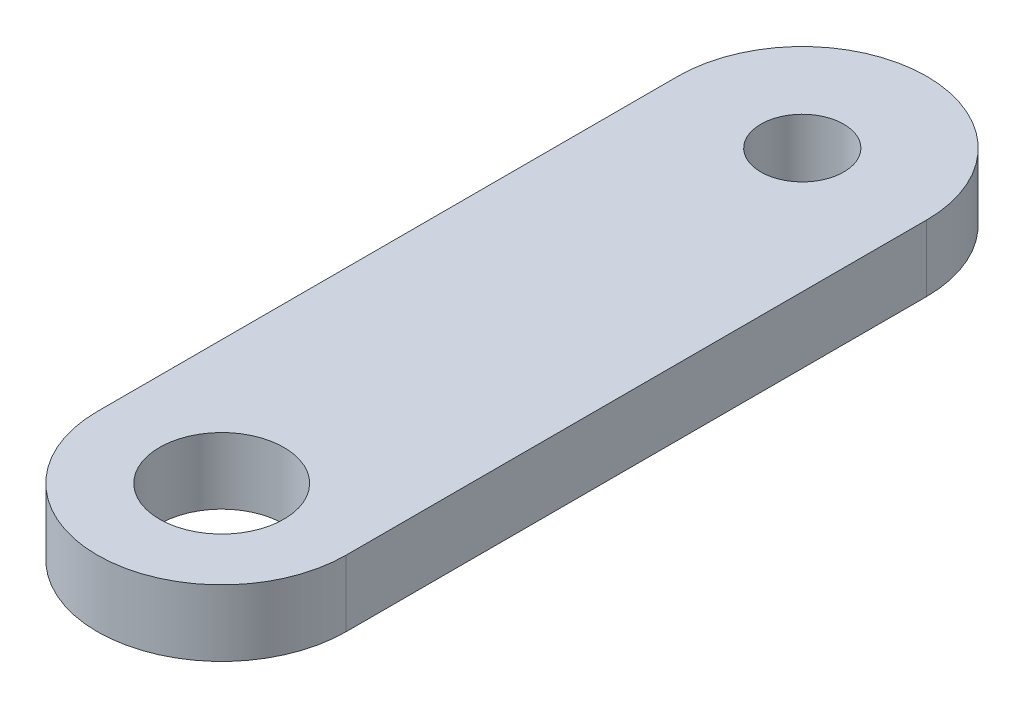
ISO-10303-21;
HEADER;
FILE_DESCRIPTION(('STEP AP214'),'2;1');
FILE_NAME('part.step','',(''),(''),'','','');
FILE_SCHEMA(('AUTOMOTIVE_DESIGN { 1 0 10303 214 1 1 1 1 }'));
ENDSEC;
DATA;
#1=APPLICATION_CONTEXT('core data for automotive mechanical design processes');
#2=APPLICATION_PROTOCOL_DEFINITION('international standard','automotive_design',2000,#1);
#3=PRODUCT_CONTEXT('',#1,'mechanical');
#4=PRODUCT('Part','Part','',(#3));
#5=PRODUCT_RELATED_PRODUCT_CATEGORY('part','',(#4));
#6=PRODUCT_DEFINITION_FORMATION('','',#4);
#7=PRODUCT_DEFINITION_CONTEXT('part definition',#1,'design');
#8=PRODUCT_DEFINITION('design','',#6,#7);
#9=PRODUCT_DEFINITION_SHAPE('','',#8);
#10=(LENGTH_UNIT() NAMED_UNIT(*) SI_UNIT(.MILLI.,.METRE.));
#11=(NAMED_UNIT(*) PLANE_ANGLE_UNIT() SI_UNIT($,.RADIAN.));
#12=(NAMED_UNIT(*) SI_UNIT($,.STERADIAN.) SOLID_ANGLE_UNIT());
#13=UNCERTAINTY_MEASURE_WITH_UNIT(LENGTH_MEASURE(1.E-05),#10,'distance_accuracy_value','');
#14=(GEOMETRIC_REPRESENTATION_CONTEXT(3) GLOBAL_UNCERTAINTY_ASSIGNED_CONTEXT((#13)) GLOBAL_UNIT_ASSIGNED_CONTEXT((#10,
#11,#12)) REPRESENTATION_CONTEXT('',''));
#15=CARTESIAN_POINT('',(0.,0.,0.));
#16=DIRECTION('',(0.,0.,1.));
#17=DIRECTION('',(1.,0.,0.));
#18=AXIS2_PLACEMENT_3D('',#15,#16,#17);
#19=CARTESIAN_POINT('',(0.,2.54,-22.225));
#20=DIRECTION('',(0.,1.,0.));
#21=DIRECTION('',(0.,0.,1.));
#22=AXIS2_PLACEMENT_3D('',#19,#20,#21);
#23=PLANE('',#22);
#24=CARTESIAN_POINT('',(0.,2.54,0.));
#25=DIRECTION('',(0.,1.,0.));
#26=DIRECTION('',(0.,0.,1.));
#27=AXIS2_PLACEMENT_3D('',#24,#25,#26);
#28=CIRCLE('',#27,2.38125);
#29=CARTESIAN_POINT('',(0.,2.54,2.38125));
#30=VERTEX_POINT('',#29);
#31=EDGE_CURVE('E110',#30,#30,#28,.T.);
#32=ORIENTED_EDGE('',*,*,#31,.F.);
#33=EDGE_LOOP('',(#32));
#34=FACE_BOUND('',#33,.T.);
#35=CARTESIAN_POINT('',(0.,2.54,-22.225));
#36=DIRECTION('',(0.,1.,0.));
#37=DIRECTION('',(0.,0.,1.));
#38=AXIS2_PLACEMENT_3D('',#35,#36,#37);
#39=CIRCLE('',#38,4.7625);
#40=CARTESIAN_POINT('',(4.7625,2.54,-22.225));
#41=VERTEX_POINT('',#40);
#42=CARTESIAN_POINT('',(-4.7625,2.54,-22.225));
#43=VERTEX_POINT('',#42);
#44=EDGE_CURVE('E95',#41,#43,#39,.T.);
#45=ORIENTED_EDGE('',*,*,#44,.T.);
#46=DIRECTION('',(0.,0.,1.));
#47=VECTOR('',#46,1.);
#48=CARTESIAN_POINT('',(-4.7625,2.54,-22.225));
#49=LINE('',#48,#47);
#50=CARTESIAN_POINT('',(-4.7625,2.54,0.));
#51=VERTEX_POINT('',#50);
#52=EDGE_CURVE('E90',#43,#51,#49,.T.);
#53=ORIENTED_EDGE('',*,*,#52,.T.);
#54=CARTESIAN_POINT('',(0.,2.54,0.));
#55=DIRECTION('',(0.,1.,0.));
#56=DIRECTION('',(0.,0.,1.));
#57=AXIS2_PLACEMENT_3D('',#54,#55,#56);
#58=CIRCLE('',#57,4.7625);
#59=CARTESIAN_POINT('',(4.7625,2.54,0.));
#60=VERTEX_POINT('',#59);
#61=EDGE_CURVE('E93',#51,#60,#58,.T.);
#62=ORIENTED_EDGE('',*,*,#61,.T.);
#63=DIRECTION('',(0.,0.,-1.));
#64=VECTOR('',#63,1.);
#65=CARTESIAN_POINT('',(4.7625,2.54,-22.225));
#66=LINE('',#65,#64);
#67=EDGE_CURVE('E60',#60,#41,#66,.T.);
#68=ORIENTED_EDGE('',*,*,#67,.T.);
#69=EDGE_LOOP('',(#45,#53,#62,#68));
#70=FACE_BOUND('',#69,.T.);
#71=CARTESIAN_POINT('',(0.,2.54,-22.225));
#72=DIRECTION('',(0.,1.,0.));
#73=DIRECTION('',(0.,0.,1.));
#74=AXIS2_PLACEMENT_3D('',#71,#72,#73);
#75=CIRCLE('',#74,1.5875);
#76=CARTESIAN_POINT('',(0.,2.54,-20.6375));
#77=VERTEX_POINT('',#76);
#78=EDGE_CURVE('E125',#77,#77,#75,.T.);
#79=ORIENTED_EDGE('',*,*,#78,.F.);
#80=EDGE_LOOP('',(#79));
#81=FACE_BOUND('',#80,.T.);
#82=ADVANCED_FACE('F43',(#34,#70,#81),#23,.T.);
#83=CARTESIAN_POINT('',(0.,0.,-22.225));
#84=DIRECTION('',(0.,1.,0.));
#85=DIRECTION('',(0.,0.,1.));
#86=AXIS2_PLACEMENT_3D('',#83,#84,#85);
#87=PLANE('',#86);
#88=CARTESIAN_POINT('',(0.,0.,-22.225));
#89=DIRECTION('',(0.,1.,0.));
#90=DIRECTION('',(0.,0.,1.));
#91=AXIS2_PLACEMENT_3D('',#88,#89,#90);
#92=CIRCLE('',#91,4.7625);
#93=CARTESIAN_POINT('',(4.7625,0.,-22.225));
#94=VERTEX_POINT('',#93);
#95=CARTESIAN_POINT('',(-4.7625,0.,-22.225));
#96=VERTEX_POINT('',#95);
#97=EDGE_CURVE('E107',#94,#96,#92,.T.);
#98=ORIENTED_EDGE('',*,*,#97,.F.);
#99=DIRECTION('',(0.,0.,-1.));
#100=VECTOR('',#99,1.);
#101=CARTESIAN_POINT('',(4.7625,0.,-22.225));
#102=LINE('',#101,#100);
#103=CARTESIAN_POINT('',(4.7625,0.,0.));
#104=VERTEX_POINT('',#103);
#105=EDGE_CURVE('E83',#104,#94,#102,.T.);
#106=ORIENTED_EDGE('',*,*,#105,.F.);
#107=CARTESIAN_POINT('',(0.,0.,0.));
#108=DIRECTION('',(0.,1.,0.));
#109=DIRECTION('',(0.,0.,1.));
#110=AXIS2_PLACEMENT_3D('',#107,#108,#109);
#111=CIRCLE('',#110,4.7625);
#112=CARTESIAN_POINT('',(-4.7625,0.,0.));
#113=VERTEX_POINT('',#112);
#114=EDGE_CURVE('E77',#113,#104,#111,.T.);
#115=ORIENTED_EDGE('',*,*,#114,.F.);
#116=DIRECTION('',(0.,0.,1.));
#117=VECTOR('',#116,1.);
#118=CARTESIAN_POINT('',(-4.7625,0.,-22.225));
#119=LINE('',#118,#117);
#120=EDGE_CURVE('E99',#96,#113,#119,.T.);
#121=ORIENTED_EDGE('',*,*,#120,.F.);
#122=EDGE_LOOP('',(#98,#106,#115,#121));
#123=FACE_BOUND('',#122,.T.);
#124=CARTESIAN_POINT('',(0.,0.,0.));
#125=DIRECTION('',(0.,1.,0.));
#126=DIRECTION('',(0.,0.,1.));
#127=AXIS2_PLACEMENT_3D('',#124,#125,#126);
#128=CIRCLE('',#127,2.38125);
#129=CARTESIAN_POINT('',(0.,0.,2.38125));
#130=VERTEX_POINT('',#129);
#131=EDGE_CURVE('E122',#130,#130,#128,.T.);
#132=ORIENTED_EDGE('',*,*,#131,.T.);
#133=EDGE_LOOP('',(#132));
#134=FACE_BOUND('',#133,.T.);
#135=CARTESIAN_POINT('',(0.,0.,-22.225));
#136=DIRECTION('',(0.,1.,0.));
#137=DIRECTION('',(0.,0.,1.));
#138=AXIS2_PLACEMENT_3D('',#135,#136,#137);
#139=CIRCLE('',#138,1.5875);
#140=CARTESIAN_POINT('',(0.,0.,-20.6375));
#141=VERTEX_POINT('',#140);
#142=EDGE_CURVE('E128',#141,#141,#139,.T.);
#143=ORIENTED_EDGE('',*,*,#142,.T.);
#144=EDGE_LOOP('',(#143));
#145=FACE_BOUND('',#144,.T.);
#146=ADVANCED_FACE('F118',(#123,#134,#145),#87,.F.);
#147=CARTESIAN_POINT('',(0.,2.54,-22.225));
#148=DIRECTION('',(0.,-1.,0.));
#149=DIRECTION('',(0.,0.,-1.));
#150=AXIS2_PLACEMENT_3D('',#147,#148,#149);
#151=CYLINDRICAL_SURFACE('',#150,4.7625);
#152=ORIENTED_EDGE('',*,*,#97,.T.);
#153=DIRECTION('',(0.,-1.,0.));
#154=VECTOR('',#153,1.);
#155=CARTESIAN_POINT('',(-4.7625,2.54,-22.225));
#156=LINE('',#155,#154);
#157=EDGE_CURVE('E13',#43,#96,#156,.T.);
#158=ORIENTED_EDGE('',*,*,#157,.F.);
#159=ORIENTED_EDGE('',*,*,#44,.F.);
#160=DIRECTION('',(0.,-1.,0.));
#161=VECTOR('',#160,1.);
#162=CARTESIAN_POINT('',(4.7625,2.54,-22.225));
#163=LINE('',#162,#161);
#164=EDGE_CURVE('E103',#41,#94,#163,.T.);
#165=ORIENTED_EDGE('',*,*,#164,.T.);
#166=EDGE_LOOP('',(#152,#158,#159,#165));
#167=FACE_BOUND('',#166,.T.);
#168=ADVANCED_FACE('F45',(#167),#151,.T.);
#169=CARTESIAN_POINT('',(-4.7625,2.54,-22.225));
#170=DIRECTION('',(1.,0.,0.));
#171=DIRECTION('',(0.,0.,-1.));
#172=AXIS2_PLACEMENT_3D('',#169,#170,#171);
#173=PLANE('',#172);
#174=ORIENTED_EDGE('',*,*,#120,.T.);
#175=DIRECTION('',(0.,-1.,0.));
#176=VECTOR('',#175,1.);
#177=CARTESIAN_POINT('',(-4.7625,2.54,0.));
#178=LINE('',#177,#176);
#179=EDGE_CURVE('E52',#51,#113,#178,.T.);
#180=ORIENTED_EDGE('',*,*,#179,.F.);
#181=ORIENTED_EDGE('',*,*,#52,.F.);
#182=ORIENTED_EDGE('',*,*,#157,.T.);
#183=EDGE_LOOP('',(#174,#180,#181,#182));
#184=FACE_BOUND('',#183,.T.);
#185=ADVANCED_FACE('F98',(#184),#173,.F.);
#186=CARTESIAN_POINT('',(0.,2.54,0.));
#187=DIRECTION('',(0.,-1.,0.));
#188=DIRECTION('',(0.,0.,-1.));
#189=AXIS2_PLACEMENT_3D('',#186,#187,#188);
#190=CYLINDRICAL_SURFACE('',#189,4.7625);
#191=ORIENTED_EDGE('',*,*,#114,.T.);
#192=DIRECTION('',(0.,-1.,0.));
#193=VECTOR('',#192,1.);
#194=CARTESIAN_POINT('',(4.7625,2.54,0.));
#195=LINE('',#194,#193);
#196=EDGE_CURVE('E100',#60,#104,#195,.T.);
#197=ORIENTED_EDGE('',*,*,#196,.F.);
#198=ORIENTED_EDGE('',*,*,#61,.F.);
#199=ORIENTED_EDGE('',*,*,#179,.T.);
#200=EDGE_LOOP('',(#191,#197,#198,#199));
#201=FACE_BOUND('',#200,.T.);
#202=ADVANCED_FACE('F101',(#201),#190,.T.);
#203=CARTESIAN_POINT('',(4.7625,2.54,-22.225));
#204=DIRECTION('',(-1.,0.,0.));
#205=DIRECTION('',(0.,0.,1.));
#206=AXIS2_PLACEMENT_3D('',#203,#204,#205);
#207=PLANE('',#206);
#208=ORIENTED_EDGE('',*,*,#105,.T.);
#209=ORIENTED_EDGE('',*,*,#164,.F.);
#210=ORIENTED_EDGE('',*,*,#67,.F.);
#211=ORIENTED_EDGE('',*,*,#196,.T.);
#212=EDGE_LOOP('',(#208,#209,#210,#211));
#213=FACE_BOUND('',#212,.T.);
#214=ADVANCED_FACE('F115',(#213),#207,.F.);
#215=CARTESIAN_POINT('',(0.,2.54,0.));
#216=DIRECTION('',(0.,-1.,0.));
#217=DIRECTION('',(0.,0.,-1.));
#218=AXIS2_PLACEMENT_3D('',#215,#216,#217);
#219=CYLINDRICAL_SURFACE('',#218,2.38125);
#220=ORIENTED_EDGE('',*,*,#31,.T.);
#221=EDGE_LOOP('',(#220));
#222=FACE_BOUND('',#221,.T.);
#223=ORIENTED_EDGE('',*,*,#131,.F.);
#224=EDGE_LOOP('',(#223));
#225=FACE_BOUND('',#224,.T.);
#226=ADVANCED_FACE('F145',(#222,#225),#219,.F.);
#227=CARTESIAN_POINT('',(0.,2.54,-22.225));
#228=DIRECTION('',(0.,-1.,0.));
#229=DIRECTION('',(0.,0.,-1.));
#230=AXIS2_PLACEMENT_3D('',#227,#228,#229);
#231=CYLINDRICAL_SURFACE('',#230,1.5875);
#232=ORIENTED_EDGE('',*,*,#78,.T.);
#233=EDGE_LOOP('',(#232));
#234=FACE_BOUND('',#233,.T.);
#235=ORIENTED_EDGE('',*,*,#142,.F.);
#236=EDGE_LOOP('',(#235));
#237=FACE_BOUND('',#236,.T.);
#238=ADVANCED_FACE('F134',(#234,#237),#231,.F.);
#239=CLOSED_SHELL('',(#82,#146,#168,#185,#202,#214,#226,#238));
#240=MANIFOLD_SOLID_BREP('B2',#239);
#241=ADVANCED_BREP_SHAPE_REPRESENTATION('',(#18,#240),#14);
#242=SHAPE_DEFINITION_REPRESENTATION(#9,#241);
ENDSEC;
END-ISO-10303-21;
